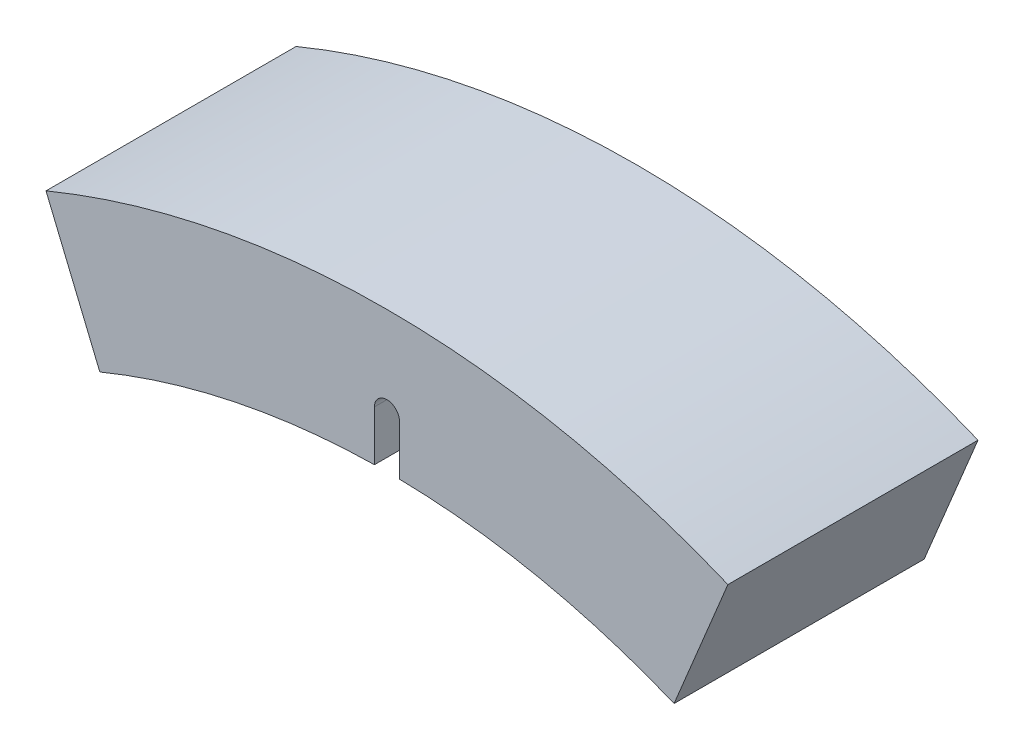
ISO-10303-21;
HEADER;
FILE_DESCRIPTION(('STEP AP214'),'2;1');
FILE_NAME('part.step','',(''),(''),'','','');
FILE_SCHEMA(('AUTOMOTIVE_DESIGN { 1 0 10303 214 1 1 1 1 }'));
ENDSEC;
DATA;
#1=APPLICATION_CONTEXT('core data for automotive mechanical design processes');
#2=APPLICATION_PROTOCOL_DEFINITION('international standard','automotive_design',2000,#1);
#3=PRODUCT_CONTEXT('',#1,'mechanical');
#4=PRODUCT('Part','Part','',(#3));
#5=PRODUCT_RELATED_PRODUCT_CATEGORY('part','',(#4));
#6=PRODUCT_DEFINITION_FORMATION('','',#4);
#7=PRODUCT_DEFINITION_CONTEXT('part definition',#1,'design');
#8=PRODUCT_DEFINITION('design','',#6,#7);
#9=PRODUCT_DEFINITION_SHAPE('','',#8);
#10=(LENGTH_UNIT() NAMED_UNIT(*) SI_UNIT(.MILLI.,.METRE.));
#11=(NAMED_UNIT(*) PLANE_ANGLE_UNIT() SI_UNIT($,.RADIAN.));
#12=(NAMED_UNIT(*) SI_UNIT($,.STERADIAN.) SOLID_ANGLE_UNIT());
#13=UNCERTAINTY_MEASURE_WITH_UNIT(LENGTH_MEASURE(1.E-05),#10,'distance_accuracy_value','');
#14=(GEOMETRIC_REPRESENTATION_CONTEXT(3) GLOBAL_UNCERTAINTY_ASSIGNED_CONTEXT((#13)) GLOBAL_UNIT_ASSIGNED_CONTEXT((#10,
#11,#12)) REPRESENTATION_CONTEXT('',''));
#15=CARTESIAN_POINT('',(0.,0.,0.));
#16=DIRECTION('',(0.,0.,1.));
#17=DIRECTION('',(1.,0.,0.));
#18=AXIS2_PLACEMENT_3D('',#15,#16,#17);
#19=CARTESIAN_POINT('',(2.,0.,-9.));
#20=DIRECTION('',(1.,0.,0.));
#21=DIRECTION('',(0.,0.,-1.));
#22=AXIS2_PLACEMENT_3D('',#19,#20,#21);
#23=PLANE('',#22);
#24=DIRECTION('',(0.,1.,0.));
#25=VECTOR('',#24,1.);
#26=CARTESIAN_POINT('',(2.,0.,0.999999999999999));
#27=LINE('',#26,#25);
#28=CARTESIAN_POINT('',(2.,119.983332175765,0.999999999999999));
#29=VERTEX_POINT('',#28);
#30=CARTESIAN_POINT('',(2.,128.,0.999999999999999));
#31=VERTEX_POINT('',#30);
#32=EDGE_CURVE('E215',#29,#31,#27,.T.);
#33=ORIENTED_EDGE('',*,*,#32,.T.);
#34=DIRECTION('',(0.,0.,1.));
#35=VECTOR('',#34,1.);
#36=CARTESIAN_POINT('',(2.,128.,-9.));
#37=LINE('',#36,#35);
#38=CARTESIAN_POINT('',(2.,128.,-9.));
#39=VERTEX_POINT('',#38);
#40=EDGE_CURVE('E144',#39,#31,#37,.T.);
#41=ORIENTED_EDGE('',*,*,#40,.F.);
#42=DIRECTION('',(0.,1.,0.));
#43=VECTOR('',#42,1.);
#44=CARTESIAN_POINT('',(2.,0.,-9.));
#45=LINE('',#44,#43);
#46=CARTESIAN_POINT('',(2.,119.983332175765,-9.));
#47=VERTEX_POINT('',#46);
#48=EDGE_CURVE('E167',#47,#39,#45,.T.);
#49=ORIENTED_EDGE('',*,*,#48,.F.);
#50=DIRECTION('',(0.,0.,1.));
#51=VECTOR('',#50,1.);
#52=CARTESIAN_POINT('',(2.,119.983332175765,-9.));
#53=LINE('',#52,#51);
#54=EDGE_CURVE('E43',#47,#29,#53,.T.);
#55=ORIENTED_EDGE('',*,*,#54,.T.);
#56=EDGE_LOOP('',(#33,#41,#49,#55));
#57=FACE_BOUND('',#56,.T.);
#58=ADVANCED_FACE('F34',(#57),#23,.F.);
#59=CARTESIAN_POINT('',(0.,128.,-9.));
#60=DIRECTION('',(0.,0.,1.));
#61=DIRECTION('',(1.,0.,0.));
#62=AXIS2_PLACEMENT_3D('',#59,#60,#61);
#63=CYLINDRICAL_SURFACE('',#62,2.);
#64=CARTESIAN_POINT('',(0.,128.,0.999999999999999));
#65=DIRECTION('',(0.,0.,1.));
#66=DIRECTION('',(1.,0.,0.));
#67=AXIS2_PLACEMENT_3D('',#64,#65,#66);
#68=CIRCLE('',#67,2.);
#69=CARTESIAN_POINT('',(-2.,128.,0.999999999999999));
#70=VERTEX_POINT('',#69);
#71=EDGE_CURVE('E212',#31,#70,#68,.T.);
#72=ORIENTED_EDGE('',*,*,#71,.T.);
#73=DIRECTION('',(0.,0.,1.));
#74=VECTOR('',#73,1.);
#75=CARTESIAN_POINT('',(-2.,128.,-9.));
#76=LINE('',#75,#74);
#77=CARTESIAN_POINT('',(-2.,128.,-9.));
#78=VERTEX_POINT('',#77);
#79=EDGE_CURVE('E151',#78,#70,#76,.T.);
#80=ORIENTED_EDGE('',*,*,#79,.F.);
#81=CARTESIAN_POINT('',(0.,128.,-9.));
#82=DIRECTION('',(0.,0.,1.));
#83=DIRECTION('',(1.,0.,0.));
#84=AXIS2_PLACEMENT_3D('',#81,#82,#83);
#85=CIRCLE('',#84,2.);
#86=EDGE_CURVE('E173',#39,#78,#85,.T.);
#87=ORIENTED_EDGE('',*,*,#86,.F.);
#88=ORIENTED_EDGE('',*,*,#40,.T.);
#89=EDGE_LOOP('',(#72,#80,#87,#88));
#90=FACE_BOUND('',#89,.T.);
#91=ADVANCED_FACE('F246',(#90),#63,.F.);
#92=CARTESIAN_POINT('',(-2.,0.,-9.));
#93=DIRECTION('',(-1.,0.,0.));
#94=DIRECTION('',(0.,0.,1.));
#95=AXIS2_PLACEMENT_3D('',#92,#93,#94);
#96=PLANE('',#95);
#97=DIRECTION('',(0.,-1.,0.));
#98=VECTOR('',#97,1.);
#99=CARTESIAN_POINT('',(-2.,0.,0.999999999999999));
#100=LINE('',#99,#98);
#101=CARTESIAN_POINT('',(-2.,119.983332175765,0.999999999999999));
#102=VERTEX_POINT('',#101);
#103=EDGE_CURVE('E209',#70,#102,#100,.T.);
#104=ORIENTED_EDGE('',*,*,#103,.T.);
#105=DIRECTION('',(0.,0.,1.));
#106=VECTOR('',#105,1.);
#107=CARTESIAN_POINT('',(-2.,119.983332175765,-9.));
#108=LINE('',#107,#106);
#109=CARTESIAN_POINT('',(-2.,119.983332175765,-9.));
#110=VERTEX_POINT('',#109);
#111=EDGE_CURVE('E155',#110,#102,#108,.T.);
#112=ORIENTED_EDGE('',*,*,#111,.F.);
#113=DIRECTION('',(0.,-1.,0.));
#114=VECTOR('',#113,1.);
#115=CARTESIAN_POINT('',(-2.,0.,-9.));
#116=LINE('',#115,#114);
#117=EDGE_CURVE('E176',#78,#110,#116,.T.);
#118=ORIENTED_EDGE('',*,*,#117,.F.);
#119=ORIENTED_EDGE('',*,*,#79,.T.);
#120=EDGE_LOOP('',(#104,#112,#118,#119));
#121=FACE_BOUND('',#120,.T.);
#122=ADVANCED_FACE('F240',(#121),#96,.F.);
#123=CARTESIAN_POINT('',(0.,0.,-9.));
#124=DIRECTION('',(0.923879532511287,-0.38268343236509,0.));
#125=DIRECTION('',(0.38268343236509,0.923879532511287,0.));
#126=AXIS2_PLACEMENT_3D('',#123,#124,#125);
#127=PLANE('',#126);
#128=DIRECTION('',(0.,0.,1.));
#129=VECTOR('',#128,1.);
#130=CARTESIAN_POINT('',(54.5323891120254,131.652833382858,-9.));
#131=LINE('',#130,#129);
#132=CARTESIAN_POINT('',(54.5323891120254,131.652833382858,-9.));
#133=VERTEX_POINT('',#132);
#134=CARTESIAN_POINT('',(54.5323891120254,131.652833382858,31.));
#135=VERTEX_POINT('',#134);
#136=EDGE_CURVE('E38',#133,#135,#131,.T.);
#137=ORIENTED_EDGE('',*,*,#136,.T.);
#138=DIRECTION('',(0.38268343236509,0.923879532511287,0.));
#139=VECTOR('',#138,1.);
#140=CARTESIAN_POINT('',(0.,0.,31.));
#141=LINE('',#140,#139);
#142=CARTESIAN_POINT('',(45.9220118838109,110.865543901354,31.));
#143=VERTEX_POINT('',#142);
#144=EDGE_CURVE('E203',#143,#135,#141,.T.);
#145=ORIENTED_EDGE('',*,*,#144,.F.);
#146=DIRECTION('',(0.,0.,1.));
#147=VECTOR('',#146,1.);
#148=CARTESIAN_POINT('',(45.9220118838109,110.865543901354,-9.));
#149=LINE('',#148,#147);
#150=CARTESIAN_POINT('',(45.9220118838109,110.865543901354,-9.));
#151=VERTEX_POINT('',#150);
#152=EDGE_CURVE('E11',#151,#143,#149,.T.);
#153=ORIENTED_EDGE('',*,*,#152,.F.);
#154=DIRECTION('',(0.38268343236509,0.923879532511287,0.));
#155=VECTOR('',#154,1.);
#156=CARTESIAN_POINT('',(0.,0.,-9.));
#157=LINE('',#156,#155);
#158=EDGE_CURVE('E183',#151,#133,#157,.T.);
#159=ORIENTED_EDGE('',*,*,#158,.T.);
#160=EDGE_LOOP('',(#137,#145,#153,#159));
#161=FACE_BOUND('',#160,.T.);
#162=ADVANCED_FACE('F36',(#161),#127,.T.);
#163=CARTESIAN_POINT('',(0.,0.,-9.));
#164=DIRECTION('',(0.,0.,1.));
#165=DIRECTION('',(1.,0.,0.));
#166=AXIS2_PLACEMENT_3D('',#163,#164,#165);
#167=CYLINDRICAL_SURFACE('',#166,120.);
#168=ORIENTED_EDGE('',*,*,#152,.T.);
#169=CARTESIAN_POINT('',(0.,0.,31.));
#170=DIRECTION('',(0.,0.,1.));
#171=DIRECTION('',(1.,0.,0.));
#172=AXIS2_PLACEMENT_3D('',#169,#170,#171);
#173=CIRCLE('',#172,120.);
#174=CARTESIAN_POINT('',(2.,119.983332175765,31.));
#175=VERTEX_POINT('',#174);
#176=EDGE_CURVE('E143',#143,#175,#173,.T.);
#177=ORIENTED_EDGE('',*,*,#176,.T.);
#178=CARTESIAN_POINT('',(2.,119.983332175765,21.));
#179=VERTEX_POINT('',#178);
#180=EDGE_CURVE('E135',#179,#175,#53,.T.);
#181=ORIENTED_EDGE('',*,*,#180,.F.);
#182=CARTESIAN_POINT('',(0.,0.,21.));
#183=DIRECTION('',(0.,0.,1.));
#184=DIRECTION('',(1.,0.,0.));
#185=AXIS2_PLACEMENT_3D('',#182,#183,#184);
#186=CIRCLE('',#185,120.);
#187=CARTESIAN_POINT('',(-2.,119.983332175765,21.));
#188=VERTEX_POINT('',#187);
#189=EDGE_CURVE('E51',#179,#188,#186,.T.);
#190=ORIENTED_EDGE('',*,*,#189,.T.);
#191=CARTESIAN_POINT('',(-2.,119.983332175765,31.));
#192=VERTEX_POINT('',#191);
#193=EDGE_CURVE('E158',#188,#192,#108,.T.);
#194=ORIENTED_EDGE('',*,*,#193,.T.);
#195=CARTESIAN_POINT('',(-45.9220118838109,110.865543901354,31.));
#196=VERTEX_POINT('',#195);
#197=EDGE_CURVE('E195',#192,#196,#173,.T.);
#198=ORIENTED_EDGE('',*,*,#197,.T.);
#199=DIRECTION('',(0.,0.,1.));
#200=VECTOR('',#199,1.);
#201=CARTESIAN_POINT('',(-45.9220118838109,110.865543901354,-9.));
#202=LINE('',#201,#200);
#203=CARTESIAN_POINT('',(-45.9220118838109,110.865543901354,-9.));
#204=VERTEX_POINT('',#203);
#205=EDGE_CURVE('E159',#204,#196,#202,.T.);
#206=ORIENTED_EDGE('',*,*,#205,.F.);
#207=CARTESIAN_POINT('',(0.,0.,-9.));
#208=DIRECTION('',(0.,0.,1.));
#209=DIRECTION('',(1.,0.,0.));
#210=AXIS2_PLACEMENT_3D('',#207,#208,#209);
#211=CIRCLE('',#210,120.);
#212=EDGE_CURVE('E169',#110,#204,#211,.T.);
#213=ORIENTED_EDGE('',*,*,#212,.F.);
#214=ORIENTED_EDGE('',*,*,#111,.T.);
#215=CARTESIAN_POINT('',(0.,0.,0.999999999999999));
#216=DIRECTION('',(0.,0.,1.));
#217=DIRECTION('',(1.,0.,0.));
#218=AXIS2_PLACEMENT_3D('',#215,#216,#217);
#219=CIRCLE('',#218,120.);
#220=EDGE_CURVE('E218',#29,#102,#219,.T.);
#221=ORIENTED_EDGE('',*,*,#220,.F.);
#222=ORIENTED_EDGE('',*,*,#54,.F.);
#223=EDGE_CURVE('E166',#151,#47,#211,.T.);
#224=ORIENTED_EDGE('',*,*,#223,.F.);
#225=EDGE_LOOP('',(#168,#177,#181,#190,#194,#198,#206,#213,#214,#221,#222,#224));
#226=FACE_BOUND('',#225,.T.);
#227=ADVANCED_FACE('F141',(#226),#167,.F.);
#228=CARTESIAN_POINT('',(2.,128.,21.));
#229=VERTEX_POINT('',#228);
#230=CARTESIAN_POINT('',(2.,128.,31.));
#231=VERTEX_POINT('',#230);
#232=EDGE_CURVE('E137',#229,#231,#37,.T.);
#233=ORIENTED_EDGE('',*,*,#232,.F.);
#234=DIRECTION('',(0.,1.,0.));
#235=VECTOR('',#234,1.);
#236=CARTESIAN_POINT('',(2.,0.,21.));
#237=LINE('',#236,#235);
#238=EDGE_CURVE('E125',#179,#229,#237,.T.);
#239=ORIENTED_EDGE('',*,*,#238,.F.);
#240=ORIENTED_EDGE('',*,*,#180,.T.);
#241=DIRECTION('',(0.,1.,0.));
#242=VECTOR('',#241,1.);
#243=CARTESIAN_POINT('',(2.,0.,31.));
#244=LINE('',#243,#242);
#245=EDGE_CURVE('E187',#175,#231,#244,.T.);
#246=ORIENTED_EDGE('',*,*,#245,.T.);
#247=EDGE_LOOP('',(#233,#239,#240,#246));
#248=FACE_BOUND('',#247,.T.);
#249=ADVANCED_FACE('F133',(#248),#23,.F.);
#250=CARTESIAN_POINT('',(-2.,128.,21.));
#251=VERTEX_POINT('',#250);
#252=CARTESIAN_POINT('',(-2.,128.,31.));
#253=VERTEX_POINT('',#252);
#254=EDGE_CURVE('E154',#251,#253,#76,.T.);
#255=ORIENTED_EDGE('',*,*,#254,.F.);
#256=CARTESIAN_POINT('',(0.,128.,21.));
#257=DIRECTION('',(0.,0.,1.));
#258=DIRECTION('',(1.,0.,0.));
#259=AXIS2_PLACEMENT_3D('',#256,#257,#258);
#260=CIRCLE('',#259,2.);
#261=EDGE_CURVE('E138',#229,#251,#260,.T.);
#262=ORIENTED_EDGE('',*,*,#261,.F.);
#263=ORIENTED_EDGE('',*,*,#232,.T.);
#264=CARTESIAN_POINT('',(0.,128.,31.));
#265=DIRECTION('',(0.,0.,1.));
#266=DIRECTION('',(1.,0.,0.));
#267=AXIS2_PLACEMENT_3D('',#264,#265,#266);
#268=CIRCLE('',#267,2.);
#269=EDGE_CURVE('E189',#231,#253,#268,.T.);
#270=ORIENTED_EDGE('',*,*,#269,.T.);
#271=EDGE_LOOP('',(#255,#262,#263,#270));
#272=FACE_BOUND('',#271,.T.);
#273=ADVANCED_FACE('F229',(#272),#63,.F.);
#274=ORIENTED_EDGE('',*,*,#193,.F.);
#275=DIRECTION('',(0.,-1.,0.));
#276=VECTOR('',#275,1.);
#277=CARTESIAN_POINT('',(-2.,0.,21.));
#278=LINE('',#277,#276);
#279=EDGE_CURVE('E128',#251,#188,#278,.T.);
#280=ORIENTED_EDGE('',*,*,#279,.F.);
#281=ORIENTED_EDGE('',*,*,#254,.T.);
#282=DIRECTION('',(0.,-1.,0.));
#283=VECTOR('',#282,1.);
#284=CARTESIAN_POINT('',(-2.,0.,31.));
#285=LINE('',#284,#283);
#286=EDGE_CURVE('E192',#253,#192,#285,.T.);
#287=ORIENTED_EDGE('',*,*,#286,.T.);
#288=EDGE_LOOP('',(#274,#280,#281,#287));
#289=FACE_BOUND('',#288,.T.);
#290=ADVANCED_FACE('F227',(#289),#96,.F.);
#291=CARTESIAN_POINT('',(0.,0.,-9.));
#292=DIRECTION('',(0.923879532511287,0.38268343236509,0.));
#293=DIRECTION('',(-0.38268343236509,0.923879532511287,0.));
#294=AXIS2_PLACEMENT_3D('',#291,#292,#293);
#295=PLANE('',#294);
#296=ORIENTED_EDGE('',*,*,#205,.T.);
#297=DIRECTION('',(-0.38268343236509,0.923879532511287,0.));
#298=VECTOR('',#297,1.);
#299=CARTESIAN_POINT('',(0.,0.,31.));
#300=LINE('',#299,#298);
#301=CARTESIAN_POINT('',(-54.5323891120254,131.652833382858,31.));
#302=VERTEX_POINT('',#301);
#303=EDGE_CURVE('E198',#196,#302,#300,.T.);
#304=ORIENTED_EDGE('',*,*,#303,.T.);
#305=DIRECTION('',(0.,0.,1.));
#306=VECTOR('',#305,1.);
#307=CARTESIAN_POINT('',(-54.5323891120254,131.652833382858,-9.));
#308=LINE('',#307,#306);
#309=CARTESIAN_POINT('',(-54.5323891120254,131.652833382858,-9.));
#310=VERTEX_POINT('',#309);
#311=EDGE_CURVE('E160',#310,#302,#308,.T.);
#312=ORIENTED_EDGE('',*,*,#311,.F.);
#313=DIRECTION('',(-0.38268343236509,0.923879532511287,0.));
#314=VECTOR('',#313,1.);
#315=CARTESIAN_POINT('',(0.,0.,-9.));
#316=LINE('',#315,#314);
#317=EDGE_CURVE('E177',#204,#310,#316,.T.);
#318=ORIENTED_EDGE('',*,*,#317,.F.);
#319=EDGE_LOOP('',(#296,#304,#312,#318));
#320=FACE_BOUND('',#319,.T.);
#321=ADVANCED_FACE('F236',(#320),#295,.F.);
#322=CARTESIAN_POINT('',(0.,0.,-9.));
#323=DIRECTION('',(0.,0.,1.));
#324=DIRECTION('',(1.,0.,0.));
#325=AXIS2_PLACEMENT_3D('',#322,#323,#324);
#326=CYLINDRICAL_SURFACE('',#325,142.5);
#327=ORIENTED_EDGE('',*,*,#311,.T.);
#328=CARTESIAN_POINT('',(0.,0.,31.));
#329=DIRECTION('',(0.,0.,1.));
#330=DIRECTION('',(1.,0.,0.));
#331=AXIS2_PLACEMENT_3D('',#328,#329,#330);
#332=CIRCLE('',#331,142.5);
#333=EDGE_CURVE('E201',#135,#302,#332,.T.);
#334=ORIENTED_EDGE('',*,*,#333,.F.);
#335=ORIENTED_EDGE('',*,*,#136,.F.);
#336=CARTESIAN_POINT('',(0.,0.,-9.));
#337=DIRECTION('',(0.,0.,1.));
#338=DIRECTION('',(1.,0.,0.));
#339=AXIS2_PLACEMENT_3D('',#336,#337,#338);
#340=CIRCLE('',#339,142.5);
#341=EDGE_CURVE('E180',#133,#310,#340,.T.);
#342=ORIENTED_EDGE('',*,*,#341,.T.);
#343=EDGE_LOOP('',(#327,#334,#335,#342));
#344=FACE_BOUND('',#343,.T.);
#345=ADVANCED_FACE('F237',(#344),#326,.T.);
#346=CARTESIAN_POINT('',(0.,0.,-9.));
#347=DIRECTION('',(0.,0.,1.));
#348=DIRECTION('',(1.,0.,0.));
#349=AXIS2_PLACEMENT_3D('',#346,#347,#348);
#350=PLANE('',#349);
#351=ORIENTED_EDGE('',*,*,#158,.F.);
#352=ORIENTED_EDGE('',*,*,#223,.T.);
#353=ORIENTED_EDGE('',*,*,#48,.T.);
#354=ORIENTED_EDGE('',*,*,#86,.T.);
#355=ORIENTED_EDGE('',*,*,#117,.T.);
#356=ORIENTED_EDGE('',*,*,#212,.T.);
#357=ORIENTED_EDGE('',*,*,#317,.T.);
#358=ORIENTED_EDGE('',*,*,#341,.F.);
#359=EDGE_LOOP('',(#351,#352,#353,#354,#355,#356,#357,#358));
#360=FACE_BOUND('',#359,.T.);
#361=ADVANCED_FACE('F238',(#360),#350,.F.);
#362=CARTESIAN_POINT('',(0.,0.,31.));
#363=DIRECTION('',(0.,0.,1.));
#364=DIRECTION('',(1.,0.,0.));
#365=AXIS2_PLACEMENT_3D('',#362,#363,#364);
#366=PLANE('',#365);
#367=ORIENTED_EDGE('',*,*,#144,.T.);
#368=ORIENTED_EDGE('',*,*,#333,.T.);
#369=ORIENTED_EDGE('',*,*,#303,.F.);
#370=ORIENTED_EDGE('',*,*,#197,.F.);
#371=ORIENTED_EDGE('',*,*,#286,.F.);
#372=ORIENTED_EDGE('',*,*,#269,.F.);
#373=ORIENTED_EDGE('',*,*,#245,.F.);
#374=ORIENTED_EDGE('',*,*,#176,.F.);
#375=EDGE_LOOP('',(#367,#368,#369,#370,#371,#372,#373,#374));
#376=FACE_BOUND('',#375,.T.);
#377=ADVANCED_FACE('F232',(#376),#366,.T.);
#378=CARTESIAN_POINT('',(0.,128.,0.999999999999999));
#379=DIRECTION('',(0.,0.,1.));
#380=DIRECTION('',(1.,0.,0.));
#381=AXIS2_PLACEMENT_3D('',#378,#379,#380);
#382=CYLINDRICAL_SURFACE('',#381,1.25);
#383=CARTESIAN_POINT('',(0.,128.,0.999999999999999));
#384=DIRECTION('',(0.,0.,1.));
#385=DIRECTION('',(1.,0.,0.));
#386=AXIS2_PLACEMENT_3D('',#383,#384,#385);
#387=CIRCLE('',#386,1.25);
#388=CARTESIAN_POINT('',(1.25,128.,0.999999999999999));
#389=VERTEX_POINT('',#388);
#390=EDGE_CURVE('E206',#389,#389,#387,.T.);
#391=ORIENTED_EDGE('',*,*,#390,.F.);
#392=EDGE_LOOP('',(#391));
#393=FACE_BOUND('',#392,.T.);
#394=CARTESIAN_POINT('',(0.,128.,21.));
#395=DIRECTION('',(0.,0.,1.));
#396=DIRECTION('',(1.,0.,0.));
#397=AXIS2_PLACEMENT_3D('',#394,#395,#396);
#398=CIRCLE('',#397,1.25);
#399=CARTESIAN_POINT('',(1.25,128.,21.));
#400=VERTEX_POINT('',#399);
#401=EDGE_CURVE('E220',#400,#400,#398,.T.);
#402=ORIENTED_EDGE('',*,*,#401,.T.);
#403=EDGE_LOOP('',(#402));
#404=FACE_BOUND('',#403,.T.);
#405=ADVANCED_FACE('F274',(#393,#404),#382,.F.);
#406=CARTESIAN_POINT('',(0.,0.,0.999999999999999));
#407=DIRECTION('',(0.,0.,1.));
#408=DIRECTION('',(1.,0.,0.));
#409=AXIS2_PLACEMENT_3D('',#406,#407,#408);
#410=PLANE('',#409);
#411=ORIENTED_EDGE('',*,*,#220,.T.);
#412=ORIENTED_EDGE('',*,*,#103,.F.);
#413=ORIENTED_EDGE('',*,*,#71,.F.);
#414=ORIENTED_EDGE('',*,*,#32,.F.);
#415=EDGE_LOOP('',(#411,#412,#413,#414));
#416=FACE_BOUND('',#415,.T.);
#417=ORIENTED_EDGE('',*,*,#390,.T.);
#418=EDGE_LOOP('',(#417));
#419=FACE_BOUND('',#418,.T.);
#420=ADVANCED_FACE('F279',(#416,#419),#410,.F.);
#421=CARTESIAN_POINT('',(0.,0.,21.));
#422=DIRECTION('',(0.,0.,1.));
#423=DIRECTION('',(1.,0.,0.));
#424=AXIS2_PLACEMENT_3D('',#421,#422,#423);
#425=PLANE('',#424);
#426=ORIENTED_EDGE('',*,*,#189,.F.);
#427=ORIENTED_EDGE('',*,*,#238,.T.);
#428=ORIENTED_EDGE('',*,*,#261,.T.);
#429=ORIENTED_EDGE('',*,*,#279,.T.);
#430=EDGE_LOOP('',(#426,#427,#428,#429));
#431=FACE_BOUND('',#430,.T.);
#432=ORIENTED_EDGE('',*,*,#401,.F.);
#433=EDGE_LOOP('',(#432));
#434=FACE_BOUND('',#433,.T.);
#435=ADVANCED_FACE('F123',(#431,#434),#425,.T.);
#436=CLOSED_SHELL('',(#58,#91,#122,#162,#227,#249,#273,#290,#321,#345,#361,#377,#405,#420,#435));
#437=MANIFOLD_SOLID_BREP('B2',#436);
#438=ADVANCED_BREP_SHAPE_REPRESENTATION('',(#18,#437),#14);
#439=SHAPE_DEFINITION_REPRESENTATION(#9,#438);
ENDSEC;
END-ISO-10303-21;
